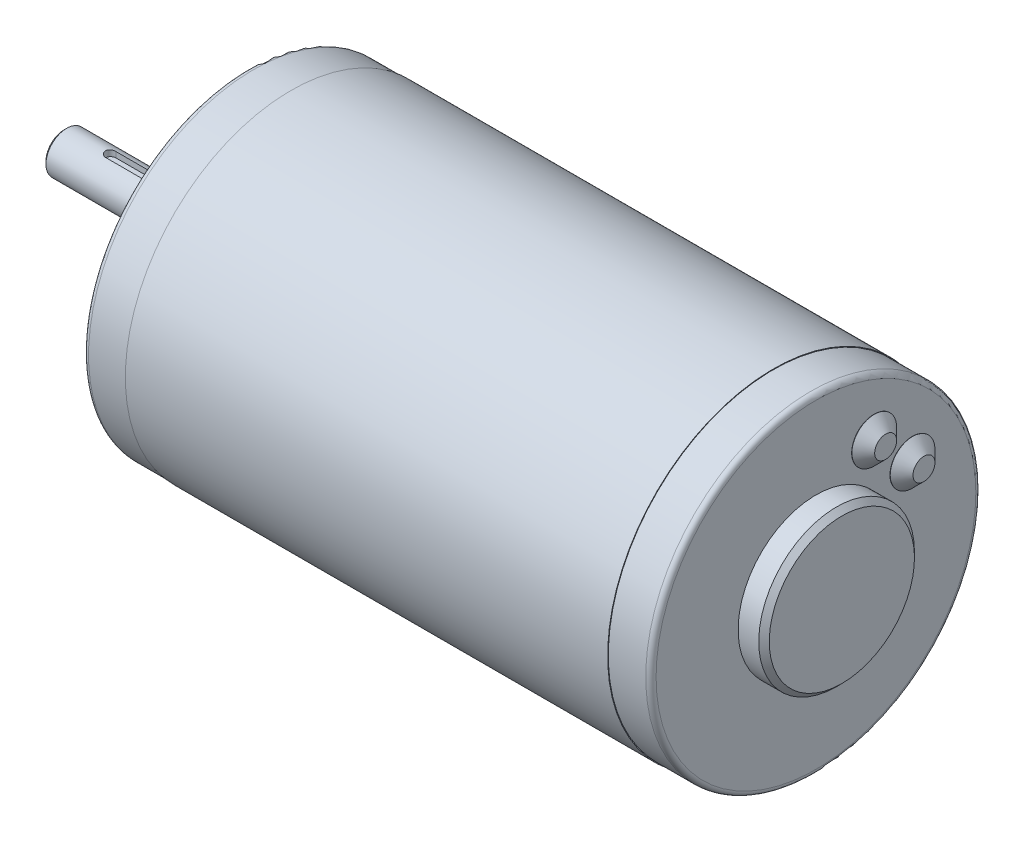
ISO-10303-21;
HEADER;
FILE_DESCRIPTION(('STEP AP214'),'2;1');
FILE_NAME('part.step','',(''),(''),'','','');
FILE_SCHEMA(('AUTOMOTIVE_DESIGN { 1 0 10303 214 1 1 1 1 }'));
ENDSEC;
DATA;
#1=APPLICATION_CONTEXT('core data for automotive mechanical design processes');
#2=APPLICATION_PROTOCOL_DEFINITION('international standard','automotive_design',2000,#1);
#3=PRODUCT_CONTEXT('',#1,'mechanical');
#4=PRODUCT('Part','Part','',(#3));
#5=PRODUCT_RELATED_PRODUCT_CATEGORY('part','',(#4));
#6=PRODUCT_DEFINITION_FORMATION('','',#4);
#7=PRODUCT_DEFINITION_CONTEXT('part definition',#1,'design');
#8=PRODUCT_DEFINITION('design','',#6,#7);
#9=PRODUCT_DEFINITION_SHAPE('','',#8);
#10=(LENGTH_UNIT() NAMED_UNIT(*) SI_UNIT(.MILLI.,.METRE.));
#11=(NAMED_UNIT(*) PLANE_ANGLE_UNIT() SI_UNIT($,.RADIAN.));
#12=(NAMED_UNIT(*) SI_UNIT($,.STERADIAN.) SOLID_ANGLE_UNIT());
#13=UNCERTAINTY_MEASURE_WITH_UNIT(LENGTH_MEASURE(1.E-05),#10,'distance_accuracy_value','');
#14=(GEOMETRIC_REPRESENTATION_CONTEXT(3) GLOBAL_UNCERTAINTY_ASSIGNED_CONTEXT((#13)) GLOBAL_UNIT_ASSIGNED_CONTEXT((#10,
#11,#12)) REPRESENTATION_CONTEXT('',''));
#15=CARTESIAN_POINT('',(0.,0.,0.));
#16=DIRECTION('',(0.,0.,1.));
#17=DIRECTION('',(1.,0.,0.));
#18=AXIS2_PLACEMENT_3D('',#15,#16,#17);
#19=CARTESIAN_POINT('',(-27.6,2.79999999999999,-1.));
#20=DIRECTION('',(0.,-1.,0.));
#21=DIRECTION('',(0.,0.,-1.));
#22=AXIS2_PLACEMENT_3D('',#19,#20,#21);
#23=PLANE('',#22);
#24=CARTESIAN_POINT('',(-7.1,2.79999999999999,0.));
#25=DIRECTION('',(0.,1.,0.));
#26=DIRECTION('',(0.,0.,1.));
#27=AXIS2_PLACEMENT_3D('',#24,#25,#26);
#28=CIRCLE('',#27,1.);
#29=CARTESIAN_POINT('',(-7.1,2.79999999999999,1.));
#30=VERTEX_POINT('',#29);
#31=CARTESIAN_POINT('',(-7.1,2.79999999999999,-1.));
#32=VERTEX_POINT('',#31);
#33=EDGE_CURVE('E79',#30,#32,#28,.T.);
#34=ORIENTED_EDGE('',*,*,#33,.T.);
#35=DIRECTION('',(1.,0.,0.));
#36=VECTOR('',#35,1.);
#37=CARTESIAN_POINT('',(-27.6,2.79999999999999,-1.));
#38=LINE('',#37,#36);
#39=CARTESIAN_POINT('',(-26.6,2.79999999999999,-1.));
#40=VERTEX_POINT('',#39);
#41=EDGE_CURVE('E74',#40,#32,#38,.T.);
#42=ORIENTED_EDGE('',*,*,#41,.F.);
#43=CARTESIAN_POINT('',(-26.6,2.79999999999999,0.));
#44=DIRECTION('',(0.,-1.,0.));
#45=DIRECTION('',(0.,0.,-1.));
#46=AXIS2_PLACEMENT_3D('',#43,#44,#45);
#47=CIRCLE('',#46,1.);
#48=CARTESIAN_POINT('',(-26.6,2.79999999999999,1.));
#49=VERTEX_POINT('',#48);
#50=EDGE_CURVE('E76',#40,#49,#47,.F.);
#51=ORIENTED_EDGE('',*,*,#50,.T.);
#52=DIRECTION('',(1.,0.,0.));
#53=VECTOR('',#52,1.);
#54=CARTESIAN_POINT('',(-27.6,2.79999999999999,1.));
#55=LINE('',#54,#53);
#56=EDGE_CURVE('E102',#49,#30,#55,.T.);
#57=ORIENTED_EDGE('',*,*,#56,.T.);
#58=EDGE_LOOP('',(#34,#42,#51,#57));
#59=FACE_BOUND('',#58,.T.);
#60=ADVANCED_FACE('F16',(#59),#23,.F.);
#61=CARTESIAN_POINT('',(-35.6,0.,0.));
#62=DIRECTION('',(-1.,0.,0.));
#63=DIRECTION('',(0.,0.,1.));
#64=AXIS2_PLACEMENT_3D('',#61,#62,#63);
#65=PLANE('',#64);
#66=CARTESIAN_POINT('',(-35.6000000000449,0.,0.));
#67=DIRECTION('',(1.,0.,0.));
#68=DIRECTION('',(0.,0.,-1.));
#69=AXIS2_PLACEMENT_3D('',#66,#67,#68);
#70=CIRCLE('',#69,3.49999999997408);
#71=CARTESIAN_POINT('',(-35.6000000000449,0.,-3.49999999997408));
#72=VERTEX_POINT('',#71);
#73=EDGE_CURVE('E325',#72,#72,#70,.T.);
#74=ORIENTED_EDGE('',*,*,#73,.F.);
#75=EDGE_LOOP('',(#74));
#76=FACE_BOUND('',#75,.T.);
#77=ADVANCED_FACE('F651',(#76),#65,.T.);
#78=CARTESIAN_POINT('',(-26.6,3.87298334620741,0.));
#79=DIRECTION('',(0.,-1.,0.));
#80=DIRECTION('',(0.,0.,-1.));
#81=AXIS2_PLACEMENT_3D('',#78,#79,#80);
#82=CYLINDRICAL_SURFACE('',#81,1.);
#83=CARTESIAN_POINT('',(-26.6,3.87298334620741,1.));
#84=CARTESIAN_POINT('',(-26.6276629851065,3.87298148580177,1.00000033749611));
#85=CARTESIAN_POINT('',(-26.6553122630182,3.8732800994947,0.998851407375366));
#86=CARTESIAN_POINT('',(-26.7104040353036,3.87445904774558,0.994271295395754));
#87=CARTESIAN_POINT('',(-26.7378465636871,3.87533928441687,0.990840497572679));
#88=CARTESIAN_POINT('',(-26.8194531732088,3.87881710972053,0.977175239382526));
#89=CARTESIAN_POINT('',(-26.8730564684822,3.88225203148808,0.963567695172493));
#90=CARTESIAN_POINT('',(-26.977124673782,3.89095422588002,0.927798076247996));
#91=CARTESIAN_POINT('',(-27.0275898782129,3.89622132630929,0.905636805423835));
#92=CARTESIAN_POINT('',(-27.1241114486473,3.90799134471939,0.853415378025864));
#93=CARTESIAN_POINT('',(-27.170166627891,3.91449459395647,0.823353103356932));
#94=CARTESIAN_POINT('',(-27.2575438819061,3.92816262398025,0.755484471828069));
#95=CARTESIAN_POINT('',(-27.2987548862455,3.93533791028915,0.717537268783975));
#96=CARTESIAN_POINT('',(-27.3743020894827,3.94945104396193,0.635275780516229));
#97=CARTESIAN_POINT('',(-27.4086371894679,3.95638885322537,0.59096047947883));
#98=CARTESIAN_POINT('',(-27.4699110016186,3.96936182283248,0.496456899401689));
#99=CARTESIAN_POINT('',(-27.496739895984,3.9753830468173,0.446195340334472));
#100=CARTESIAN_POINT('',(-27.5415247341967,3.98572346250588,0.341702590842916));
#101=CARTESIAN_POINT('',(-27.5594824242998,3.990042989147,0.287472184083007));
#102=CARTESIAN_POINT('',(-27.5856589927774,3.99641900005128,0.177744108525158));
#103=CARTESIAN_POINT('',(-27.5940676724228,3.998519529013,0.122294322002856));
#104=CARTESIAN_POINT('',(-27.6015033715433,4.00037438150815,0.0107327756816781));
#105=CARTESIAN_POINT('',(-27.6005315701923,4.00012899993444,-0.0453789000287067));
#106=CARTESIAN_POINT('',(-27.5893700363146,3.99735237365735,-0.155352492972096));
#107=CARTESIAN_POINT('',(-27.5793853834005,3.9948719867736,-0.209236701739855));
#108=CARTESIAN_POINT('',(-27.5508113208173,3.98796330636495,-0.31453871108434));
#109=CARTESIAN_POINT('',(-27.5322215304314,3.98353492665556,-0.365956402423988));
#110=CARTESIAN_POINT('',(-27.4867987193294,3.97314997761798,-0.46540728602454));
#111=CARTESIAN_POINT('',(-27.4598926057672,3.96717993827555,-0.513405629602248));
#112=CARTESIAN_POINT('',(-27.3986568701665,3.95435945541919,-0.604276631230015));
#113=CARTESIAN_POINT('',(-27.3643261297468,3.94750887933198,-0.64714851556229));
#114=CARTESIAN_POINT('',(-27.2881210879187,3.93345566022865,-0.727769389708492));
#115=CARTESIAN_POINT('',(-27.2460683634602,3.92624850477685,-0.765349103054128));
#116=CARTESIAN_POINT('',(-27.1561701330723,3.91246168284006,-0.832969575186237));
#117=CARTESIAN_POINT('',(-27.1083230467164,3.90588218842993,-0.863008270245062));
#118=CARTESIAN_POINT('',(-27.0078544021762,3.89407813586325,-0.914804709285961));
#119=CARTESIAN_POINT('',(-26.9552085351039,3.88886106009136,-0.936517017887269));
#120=CARTESIAN_POINT('',(-26.8468830715817,3.88047058807054,-0.970702351849828));
#121=CARTESIAN_POINT('',(-26.7912081448502,3.87729413761435,-0.983189189212131));
#122=CARTESIAN_POINT('',(-26.7125426192411,3.87455290681524,-0.993904635150938));
#123=CARTESIAN_POINT('',(-26.6900802967868,3.87396523110859,-0.996190790966708));
#124=CARTESIAN_POINT('',(-26.6450822100907,3.87318062488974,-0.999236757697394));
#125=CARTESIAN_POINT('',(-26.6225466240447,3.87298306219461,-0.999999038096045));
#126=CARTESIAN_POINT('',(-26.6,3.87298334620741,-1.));
#127=B_SPLINE_CURVE_WITH_KNOTS('',3,(#83,#84,#85,#86,#87,#88,#89,#90,#91,#92,#93,#94,#95,#96,
#97,#98,#99,#100,#101,#102,#103,#104,#105,#106,#107,#108,#109,#110,#111,#112,#113,#114,#115,
#116,#117,#118,#119,#120,#121,#122,#123,#124,#125,#126),.UNSPECIFIED.,.F.,.F.,(4,2,2,2,2,2,2,2,
2,2,2,2,2,2,2,2,2,2,2,2,2,4),(0.,0.0829365303397727,0.165859106084653,0.331229963080318,
0.496585282091499,0.661984974726751,0.830641897427976,0.999325753539196,1.17036187098235,
1.34136430732425,1.50890481515325,1.67642426256639,1.84022545479276,2.00403389475838,
2.16932509450376,2.33464120964329,2.50441429534542,2.67423379180967,2.84496720161068,
3.01544447539986,3.08315848722649,3.15076267731671),.UNSPECIFIED.);
#128=CARTESIAN_POINT('',(-26.6,3.87298334620741,1.));
#129=VERTEX_POINT('',#128);
#130=CARTESIAN_POINT('',(-26.6,3.87298334620741,-1.));
#131=VERTEX_POINT('',#130);
#132=EDGE_CURVE('E160',#129,#131,#127,.T.);
#133=ORIENTED_EDGE('',*,*,#132,.F.);
#134=DIRECTION('',(0.,1.,0.));
#135=VECTOR('',#134,1.);
#136=CARTESIAN_POINT('',(-26.6,2.79999999999999,1.));
#137=LINE('',#136,#135);
#138=EDGE_CURVE('E89',#129,#49,#137,.F.);
#139=ORIENTED_EDGE('',*,*,#138,.T.);
#140=ORIENTED_EDGE('',*,*,#50,.F.);
#141=DIRECTION('',(0.,1.,0.));
#142=VECTOR('',#141,1.);
#143=CARTESIAN_POINT('',(-26.6,2.79999999999999,-1.));
#144=LINE('',#143,#142);
#145=EDGE_CURVE('E83',#131,#40,#144,.F.);
#146=ORIENTED_EDGE('',*,*,#145,.F.);
#147=EDGE_LOOP('',(#133,#139,#140,#146));
#148=FACE_BOUND('',#147,.T.);
#149=ADVANCED_FACE('F86',(#148),#82,.F.);
#150=CARTESIAN_POINT('',(-27.6,2.79999999999999,-1.));
#151=DIRECTION('',(0.,0.,1.));
#152=DIRECTION('',(1.,0.,0.));
#153=AXIS2_PLACEMENT_3D('',#150,#151,#152);
#154=PLANE('',#153);
#155=DIRECTION('',(1.,0.,0.));
#156=VECTOR('',#155,1.);
#157=CARTESIAN_POINT('',(0.,3.87298334620741,-1.));
#158=LINE('',#157,#156);
#159=CARTESIAN_POINT('',(-7.1,3.87298334620741,-1.));
#160=VERTEX_POINT('',#159);
#161=EDGE_CURVE('E94',#131,#160,#158,.T.);
#162=ORIENTED_EDGE('',*,*,#161,.F.);
#163=ORIENTED_EDGE('',*,*,#145,.T.);
#164=ORIENTED_EDGE('',*,*,#41,.T.);
#165=DIRECTION('',(0.,1.,0.));
#166=VECTOR('',#165,1.);
#167=CARTESIAN_POINT('',(-7.1,2.79999999999999,-1.));
#168=LINE('',#167,#166);
#169=EDGE_CURVE('E97',#32,#160,#168,.T.);
#170=ORIENTED_EDGE('',*,*,#169,.T.);
#171=EDGE_LOOP('',(#162,#163,#164,#170));
#172=FACE_BOUND('',#171,.T.);
#173=ADVANCED_FACE('F92',(#172),#154,.T.);
#174=CARTESIAN_POINT('',(-7.1,2.79999999999999,0.));
#175=DIRECTION('',(0.,1.,0.));
#176=DIRECTION('',(0.,0.,1.));
#177=AXIS2_PLACEMENT_3D('',#174,#175,#176);
#178=CYLINDRICAL_SURFACE('',#177,1.);
#179=ORIENTED_EDGE('',*,*,#33,.F.);
#180=DIRECTION('',(0.,1.,0.));
#181=VECTOR('',#180,1.);
#182=CARTESIAN_POINT('',(-7.1,2.79999999999999,1.));
#183=LINE('',#182,#181);
#184=CARTESIAN_POINT('',(-7.1,3.87298334620741,1.));
#185=VERTEX_POINT('',#184);
#186=EDGE_CURVE('E103',#30,#185,#183,.T.);
#187=ORIENTED_EDGE('',*,*,#186,.T.);
#188=CARTESIAN_POINT('',(-7.1,3.87298334620741,-1.));
#189=CARTESIAN_POINT('',(-7.07233701489346,3.87298148580177,-1.00000033749611));
#190=CARTESIAN_POINT('',(-7.04468773698177,3.8732800994947,-0.998851407375366));
#191=CARTESIAN_POINT('',(-6.98959596469644,3.87445904774558,-0.994271295395754));
#192=CARTESIAN_POINT('',(-6.96215343631291,3.87533928441687,-0.990840497572679));
#193=CARTESIAN_POINT('',(-6.88054682679116,3.87881710972053,-0.977175239382526));
#194=CARTESIAN_POINT('',(-6.82694353151779,3.88225203148808,-0.963567695172493));
#195=CARTESIAN_POINT('',(-6.72287532621804,3.89095422588002,-0.927798076247997));
#196=CARTESIAN_POINT('',(-6.67241012178714,3.89622132630929,-0.905636805423836));
#197=CARTESIAN_POINT('',(-6.57588855135267,3.90799134471939,-0.853415378025865));
#198=CARTESIAN_POINT('',(-6.52983337210904,3.91449459395647,-0.823353103356933));
#199=CARTESIAN_POINT('',(-6.4424561180939,3.92816262398025,-0.755484471828069));
#200=CARTESIAN_POINT('',(-6.40124511375448,3.93533791028915,-0.717537268783976));
#201=CARTESIAN_POINT('',(-6.32569791051729,3.94945104396193,-0.63527578051623));
#202=CARTESIAN_POINT('',(-6.29136281053206,3.95638885322537,-0.590960479478831));
#203=CARTESIAN_POINT('',(-6.23008899838136,3.96936182283248,-0.496456899401691));
#204=CARTESIAN_POINT('',(-6.20326010401603,3.9753830468173,-0.446195340334474));
#205=CARTESIAN_POINT('',(-6.1584752658033,3.98572346250588,-0.341702590842919));
#206=CARTESIAN_POINT('',(-6.14051757570017,3.990042989147,-0.28747218408301));
#207=CARTESIAN_POINT('',(-6.11434100722257,3.99641900005128,-0.17774410852516));
#208=CARTESIAN_POINT('',(-6.10593232757718,3.998519529013,-0.122294322002858));
#209=CARTESIAN_POINT('',(-6.09849662845671,4.00037438150815,-0.0107327756816796));
#210=CARTESIAN_POINT('',(-6.09946842980766,4.00012899993444,0.0453789000287057));
#211=CARTESIAN_POINT('',(-6.11062996368545,3.99735237365735,0.155352492972096));
#212=CARTESIAN_POINT('',(-6.12061461659948,3.9948719867736,0.209236701739855));
#213=CARTESIAN_POINT('',(-6.14918867918275,3.98796330636495,0.31453871108434));
#214=CARTESIAN_POINT('',(-6.16777846956858,3.98353492665556,0.365956402423988));
#215=CARTESIAN_POINT('',(-6.21320128067065,3.97314997761798,0.465407286024539));
#216=CARTESIAN_POINT('',(-6.24010739423284,3.96717993827555,0.513405629602248));
#217=CARTESIAN_POINT('',(-6.30134312983347,3.95435945541919,0.604276631230014));
#218=CARTESIAN_POINT('',(-6.33567387025322,3.94750887933198,0.647148515562289));
#219=CARTESIAN_POINT('',(-6.41187891208131,3.93345566022865,0.72776938970849));
#220=CARTESIAN_POINT('',(-6.45393163653981,3.92624850477685,0.765349103054127));
#221=CARTESIAN_POINT('',(-6.54382986692773,3.91246168284006,0.832969575186237));
#222=CARTESIAN_POINT('',(-6.59167695328356,3.90588218842993,0.863008270245062));
#223=CARTESIAN_POINT('',(-6.69214559782377,3.89407813586325,0.914804709285962));
#224=CARTESIAN_POINT('',(-6.74479146489609,3.88886106009136,0.936517017887269));
#225=CARTESIAN_POINT('',(-6.85311692841829,3.88047058807055,0.970702351849829));
#226=CARTESIAN_POINT('',(-6.90879185514984,3.87729413761435,0.983189189212132));
#227=CARTESIAN_POINT('',(-6.9874573807589,3.87455290681524,0.993904635150938));
#228=CARTESIAN_POINT('',(-7.00991970321318,3.87396523110859,0.996190790966708));
#229=CARTESIAN_POINT('',(-7.05491778990932,3.87318062488974,0.999236757697394));
#230=CARTESIAN_POINT('',(-7.07745337595529,3.87298306219461,0.999999038096045));
#231=CARTESIAN_POINT('',(-7.1,3.87298334620741,1.));
#232=B_SPLINE_CURVE_WITH_KNOTS('',3,(#188,#189,#190,#191,#192,#193,#194,#195,#196,#197,#198,
#199,#200,#201,#202,#203,#204,#205,#206,#207,#208,#209,#210,#211,#212,#213,#214,#215,#216,#217,
#218,#219,#220,#221,#222,#223,#224,#225,#226,#227,#228,#229,#230,#231),.UNSPECIFIED.,.F.,.F.,(4,
2,2,2,2,2,2,2,2,2,2,2,2,2,2,2,2,2,2,2,2,4),(0.,0.0829365303397693,0.165859106084651,
0.331229963080317,0.496585282091498,0.661984974726749,0.830641897427974,0.999325753539193,
1.17036187098235,1.34136430732424,1.50890481515325,1.67642426256639,1.84022545479276,
2.00403389475838,2.16932509450376,2.33464120964329,2.50441429534542,2.67423379180967,
2.84496720161068,3.01544447539986,3.08315848722648,3.15076267731671),.UNSPECIFIED.);
#233=EDGE_CURVE('E151',#160,#185,#232,.T.);
#234=ORIENTED_EDGE('',*,*,#233,.F.);
#235=ORIENTED_EDGE('',*,*,#169,.F.);
#236=EDGE_LOOP('',(#179,#187,#234,#235));
#237=FACE_BOUND('',#236,.T.);
#238=ADVANCED_FACE('F166',(#237),#178,.F.);
#239=CARTESIAN_POINT('',(-27.6,2.79999999999999,1.));
#240=DIRECTION('',(0.,0.,1.));
#241=DIRECTION('',(1.,0.,0.));
#242=AXIS2_PLACEMENT_3D('',#239,#240,#241);
#243=PLANE('',#242);
#244=ORIENTED_EDGE('',*,*,#186,.F.);
#245=ORIENTED_EDGE('',*,*,#56,.F.);
#246=ORIENTED_EDGE('',*,*,#138,.F.);
#247=DIRECTION('',(1.,0.,0.));
#248=VECTOR('',#247,1.);
#249=CARTESIAN_POINT('',(0.,3.87298334620741,1.));
#250=LINE('',#249,#248);
#251=EDGE_CURVE('E159',#185,#129,#250,.F.);
#252=ORIENTED_EDGE('',*,*,#251,.F.);
#253=EDGE_LOOP('',(#244,#245,#246,#252));
#254=FACE_BOUND('',#253,.T.);
#255=ADVANCED_FACE('F181',(#254),#243,.F.);
#256=CARTESIAN_POINT('',(-35.0999999999999,0.,0.));
#257=DIRECTION('',(1.,0.,0.));
#258=DIRECTION('',(0.,0.,-1.));
#259=AXIS2_PLACEMENT_3D('',#256,#257,#258);
#260=CONICAL_SURFACE('',#259,3.99999999996226,0.785398163340605);
#261=ORIENTED_EDGE('',*,*,#73,.T.);
#262=EDGE_LOOP('',(#261));
#263=FACE_BOUND('',#262,.T.);
#264=CARTESIAN_POINT('',(-35.1,0.,0.));
#265=DIRECTION('',(1.,0.,0.));
#266=DIRECTION('',(0.,0.,-1.));
#267=AXIS2_PLACEMENT_3D('',#264,#265,#266);
#268=CIRCLE('',#267,4.);
#269=CARTESIAN_POINT('',(-35.1,0.,-4.));
#270=VERTEX_POINT('',#269);
#271=EDGE_CURVE('E150',#270,#270,#268,.T.);
#272=ORIENTED_EDGE('',*,*,#271,.F.);
#273=EDGE_LOOP('',(#272));
#274=FACE_BOUND('',#273,.T.);
#275=ADVANCED_FACE('F176',(#263,#274),#260,.T.);
#276=CARTESIAN_POINT('',(0.,0.,0.));
#277=DIRECTION('',(1.,0.,0.));
#278=DIRECTION('',(0.,0.,-1.));
#279=AXIS2_PLACEMENT_3D('',#276,#277,#278);
#280=CYLINDRICAL_SURFACE('',#279,4.);
#281=ORIENTED_EDGE('',*,*,#271,.T.);
#282=EDGE_LOOP('',(#281));
#283=FACE_BOUND('',#282,.T.);
#284=CARTESIAN_POINT('',(-4.,0.,0.));
#285=DIRECTION('',(1.,0.,0.));
#286=DIRECTION('',(0.,0.,-1.));
#287=AXIS2_PLACEMENT_3D('',#284,#285,#286);
#288=CIRCLE('',#287,4.);
#289=CARTESIAN_POINT('',(-4.,0.,-4.));
#290=VERTEX_POINT('',#289);
#291=EDGE_CURVE('E147',#290,#290,#288,.T.);
#292=ORIENTED_EDGE('',*,*,#291,.F.);
#293=EDGE_LOOP('',(#292));
#294=FACE_BOUND('',#293,.T.);
#295=ORIENTED_EDGE('',*,*,#233,.T.);
#296=ORIENTED_EDGE('',*,*,#251,.T.);
#297=ORIENTED_EDGE('',*,*,#132,.T.);
#298=ORIENTED_EDGE('',*,*,#161,.T.);
#299=EDGE_LOOP('',(#295,#296,#297,#298));
#300=FACE_BOUND('',#299,.T.);
#301=ADVANCED_FACE('F170',(#283,#294,#300),#280,.T.);
#302=CARTESIAN_POINT('',(-4.,4.,0.));
#303=DIRECTION('',(-1.,0.,0.));
#304=DIRECTION('',(0.,0.,1.));
#305=AXIS2_PLACEMENT_3D('',#302,#303,#304);
#306=PLANE('',#305);
#307=ORIENTED_EDGE('',*,*,#291,.T.);
#308=EDGE_LOOP('',(#307));
#309=FACE_BOUND('',#308,.T.);
#310=CARTESIAN_POINT('',(-4.,0.,0.));
#311=DIRECTION('',(1.,0.,0.));
#312=DIRECTION('',(0.,1.,0.));
#313=AXIS2_PLACEMENT_3D('',#310,#311,#312);
#314=CIRCLE('',#313,8.509);
#315=CARTESIAN_POINT('',(-4.,8.509,0.));
#316=VERTEX_POINT('',#315);
#317=EDGE_CURVE('E144',#316,#316,#314,.T.);
#318=ORIENTED_EDGE('',*,*,#317,.F.);
#319=EDGE_LOOP('',(#318));
#320=FACE_BOUND('',#319,.T.);
#321=ADVANCED_FACE('F175',(#309,#320),#306,.T.);
#322=CARTESIAN_POINT('',(111.8479,18.6070906828553,-11.2073596390943));
#323=DIRECTION('',(1.,0.,0.));
#324=DIRECTION('',(0.,0.,-1.));
#325=AXIS2_PLACEMENT_3D('',#322,#323,#324);
#326=PLANE('',#325);
#327=CARTESIAN_POINT('',(111.84789999993,18.6070906828553,-11.2073596390943));
#328=DIRECTION('',(-1.,0.,0.));
#329=DIRECTION('',(0.,-1.,0.));
#330=AXIS2_PLACEMENT_3D('',#327,#328,#329);
#331=CIRCLE('',#330,2.11800000003146);
#332=CARTESIAN_POINT('',(111.84789999993,16.4890906828238,-11.2073596390943));
#333=VERTEX_POINT('',#332);
#334=EDGE_CURVE('E141',#333,#333,#331,.T.);
#335=ORIENTED_EDGE('',*,*,#334,.F.);
#336=EDGE_LOOP('',(#335));
#337=FACE_BOUND('',#336,.T.);
#338=ADVANCED_FACE('F384',(#337),#326,.T.);
#339=CARTESIAN_POINT('',(114.6,15.0368,0.));
#340=DIRECTION('',(1.,0.,0.));
#341=DIRECTION('',(0.,0.,-1.));
#342=AXIS2_PLACEMENT_3D('',#339,#340,#341);
#343=PLANE('',#342);
#344=CARTESIAN_POINT('',(114.6,0.,0.));
#345=DIRECTION('',(-1.,0.,0.));
#346=DIRECTION('',(0.,-1.,0.));
#347=AXIS2_PLACEMENT_3D('',#344,#345,#346);
#348=CIRCLE('',#347,14.0208);
#349=CARTESIAN_POINT('',(114.6,-14.0208,0.));
#350=VERTEX_POINT('',#349);
#351=EDGE_CURVE('E138',#350,#350,#348,.T.);
#352=ORIENTED_EDGE('',*,*,#351,.F.);
#353=EDGE_LOOP('',(#352));
#354=FACE_BOUND('',#353,.T.);
#355=ADVANCED_FACE('F425',(#354),#343,.T.);
#356=CARTESIAN_POINT('',(111.8479,11.2073596390943,-18.6070906828553));
#357=DIRECTION('',(1.,0.,0.));
#358=DIRECTION('',(0.,0.,-1.));
#359=AXIS2_PLACEMENT_3D('',#356,#357,#358);
#360=PLANE('',#359);
#361=CARTESIAN_POINT('',(111.84789999993,11.2073596390943,-18.6070906828553));
#362=DIRECTION('',(-1.,0.,0.));
#363=DIRECTION('',(0.,0.,1.));
#364=AXIS2_PLACEMENT_3D('',#361,#362,#363);
#365=CIRCLE('',#364,2.1180000000021);
#366=CARTESIAN_POINT('',(111.84789999993,11.2073596390943,-16.4890906828532));
#367=VERTEX_POINT('',#366);
#368=EDGE_CURVE('E134',#367,#367,#365,.T.);
#369=ORIENTED_EDGE('',*,*,#368,.F.);
#370=EDGE_LOOP('',(#369));
#371=FACE_BOUND('',#370,.T.);
#372=ADVANCED_FACE('F428',(#371),#360,.T.);
#373=CARTESIAN_POINT('',(13.6143999999945,25.4,0.));
#374=DIRECTION('',(-1.,0.,0.));
#375=DIRECTION('',(0.,0.,1.));
#376=AXIS2_PLACEMENT_3D('',#373,#374,#375);
#377=CONICAL_SURFACE('',#376,2.01929999997219,1.02974425867198);
#378=CARTESIAN_POINT('',(14.827717847993,25.4,0.));
#379=VERTEX_POINT('',#378);
#380=VERTEX_LOOP('',#379);
#381=FACE_BOUND('',#380,.T.);
#382=CARTESIAN_POINT('',(13.6144,25.4,0.));
#383=DIRECTION('',(-1.,0.,0.));
#384=DIRECTION('',(0.,0.,1.));
#385=AXIS2_PLACEMENT_3D('',#382,#383,#384);
#386=CIRCLE('',#385,2.0193);
#387=CARTESIAN_POINT('',(13.6144,25.4,2.0193));
#388=VERTEX_POINT('',#387);
#389=EDGE_CURVE('E137',#388,#388,#386,.T.);
#390=ORIENTED_EDGE('',*,*,#389,.T.);
#391=EDGE_LOOP('',(#390));
#392=FACE_BOUND('',#391,.T.);
#393=ADVANCED_FACE('F443',(#381,#392),#377,.F.);
#394=CARTESIAN_POINT('',(13.6143999999945,-25.4,0.));
#395=DIRECTION('',(-1.,0.,0.));
#396=DIRECTION('',(0.,0.,1.));
#397=AXIS2_PLACEMENT_3D('',#394,#395,#396);
#398=CONICAL_SURFACE('',#397,2.01929999997219,1.02974425867198);
#399=CARTESIAN_POINT('',(14.827717847993,-25.4,0.));
#400=VERTEX_POINT('',#399);
#401=VERTEX_LOOP('',#400);
#402=FACE_BOUND('',#401,.T.);
#403=CARTESIAN_POINT('',(13.6144,-25.4,0.));
#404=DIRECTION('',(-1.,0.,0.));
#405=DIRECTION('',(0.,0.,1.));
#406=AXIS2_PLACEMENT_3D('',#403,#404,#405);
#407=CIRCLE('',#406,2.0193);
#408=CARTESIAN_POINT('',(13.6144,-25.4,2.0193));
#409=VERTEX_POINT('',#408);
#410=EDGE_CURVE('E315',#409,#409,#407,.T.);
#411=ORIENTED_EDGE('',*,*,#410,.T.);
#412=EDGE_LOOP('',(#411));
#413=FACE_BOUND('',#412,.T.);
#414=ADVANCED_FACE('F374',(#402,#413),#398,.F.);
#415=CARTESIAN_POINT('',(-2.984,0.,0.));
#416=DIRECTION('',(1.,0.,0.));
#417=DIRECTION('',(0.,1.,0.));
#418=AXIS2_PLACEMENT_3D('',#415,#416,#417);
#419=CONICAL_SURFACE('',#418,9.525,0.78539816339745);
#420=ORIENTED_EDGE('',*,*,#317,.T.);
#421=EDGE_LOOP('',(#420));
#422=FACE_BOUND('',#421,.T.);
#423=CARTESIAN_POINT('',(-2.984,0.,0.));
#424=DIRECTION('',(1.,0.,0.));
#425=DIRECTION('',(0.,0.,-1.));
#426=AXIS2_PLACEMENT_3D('',#423,#424,#425);
#427=CIRCLE('',#426,9.525);
#428=CARTESIAN_POINT('',(-2.984,0.,-9.525));
#429=VERTEX_POINT('',#428);
#430=EDGE_CURVE('E312',#429,#429,#427,.T.);
#431=ORIENTED_EDGE('',*,*,#430,.F.);
#432=EDGE_LOOP('',(#431));
#433=FACE_BOUND('',#432,.T.);
#434=ADVANCED_FACE('F369',(#422,#433),#419,.T.);
#435=CARTESIAN_POINT('',(109.647900000027,18.6070906828553,-11.2073596390943));
#436=DIRECTION('',(-1.,0.,0.));
#437=DIRECTION('',(0.,-1.,0.));
#438=AXIS2_PLACEMENT_3D('',#435,#436,#437);
#439=CONICAL_SURFACE('',#438,4.31799999987712,0.785398163384529);
#440=CARTESIAN_POINT('',(109.6479,18.6070906828553,-11.2073596390943));
#441=DIRECTION('',(-1.,0.,0.));
#442=DIRECTION('',(0.,0.,1.));
#443=AXIS2_PLACEMENT_3D('',#440,#441,#442);
#444=CIRCLE('',#443,4.318);
#445=CARTESIAN_POINT('',(109.6479,18.6070906828553,-6.88935963909434));
#446=VERTEX_POINT('',#445);
#447=EDGE_CURVE('E309',#446,#446,#444,.T.);
#448=ORIENTED_EDGE('',*,*,#447,.F.);
#449=EDGE_LOOP('',(#448));
#450=FACE_BOUND('',#449,.T.);
#451=ORIENTED_EDGE('',*,*,#334,.T.);
#452=EDGE_LOOP('',(#451));
#453=FACE_BOUND('',#452,.T.);
#454=ADVANCED_FACE('F373',(#450,#453),#439,.T.);
#455=CARTESIAN_POINT('',(113.584,0.,0.));
#456=DIRECTION('',(-1.,0.,0.));
#457=DIRECTION('',(0.,-1.,0.));
#458=AXIS2_PLACEMENT_3D('',#455,#456,#457);
#459=CONICAL_SURFACE('',#458,15.0368,0.785398163397441);
#460=ORIENTED_EDGE('',*,*,#351,.T.);
#461=EDGE_LOOP('',(#460));
#462=FACE_BOUND('',#461,.T.);
#463=CARTESIAN_POINT('',(113.584,0.,0.));
#464=DIRECTION('',(1.,0.,0.));
#465=DIRECTION('',(0.,0.,-1.));
#466=AXIS2_PLACEMENT_3D('',#463,#464,#465);
#467=CIRCLE('',#466,15.0368);
#468=CARTESIAN_POINT('',(113.584,0.,-15.0368));
#469=VERTEX_POINT('',#468);
#470=EDGE_CURVE('E306',#469,#469,#467,.F.);
#471=ORIENTED_EDGE('',*,*,#470,.F.);
#472=EDGE_LOOP('',(#471));
#473=FACE_BOUND('',#472,.T.);
#474=ADVANCED_FACE('F416',(#462,#473),#459,.T.);
#475=CARTESIAN_POINT('',(109.647900000084,11.2073596390943,-18.6070906828553));
#476=DIRECTION('',(-1.,0.,0.));
#477=DIRECTION('',(0.,0.,1.));
#478=AXIS2_PLACEMENT_3D('',#475,#476,#477);
#479=CONICAL_SURFACE('',#478,4.31799999990461,0.785398163410367);
#480=CARTESIAN_POINT('',(109.6479,11.2073596390943,-18.6070906828553));
#481=DIRECTION('',(-1.,0.,0.));
#482=DIRECTION('',(0.,0.,1.));
#483=AXIS2_PLACEMENT_3D('',#480,#481,#482);
#484=CIRCLE('',#483,4.318);
#485=CARTESIAN_POINT('',(109.6479,11.2073596390943,-14.2890906828553));
#486=VERTEX_POINT('',#485);
#487=EDGE_CURVE('E133',#486,#486,#484,.T.);
#488=ORIENTED_EDGE('',*,*,#487,.F.);
#489=EDGE_LOOP('',(#488));
#490=FACE_BOUND('',#489,.T.);
#491=ORIENTED_EDGE('',*,*,#368,.T.);
#492=EDGE_LOOP('',(#491));
#493=FACE_BOUND('',#492,.T.);
#494=ADVANCED_FACE('F419',(#490,#493),#479,.T.);
#495=CARTESIAN_POINT('',(0.,25.4,0.));
#496=DIRECTION('',(-1.,0.,0.));
#497=DIRECTION('',(0.,0.,1.));
#498=AXIS2_PLACEMENT_3D('',#495,#496,#497);
#499=CYLINDRICAL_SURFACE('',#498,2.0193);
#500=CARTESIAN_POINT('',(0.,25.4,0.));
#501=DIRECTION('',(-1.,0.,0.));
#502=DIRECTION('',(0.,0.,1.));
#503=AXIS2_PLACEMENT_3D('',#500,#501,#502);
#504=CIRCLE('',#503,2.0193);
#505=CARTESIAN_POINT('',(0.,25.4,2.0193));
#506=VERTEX_POINT('',#505);
#507=EDGE_CURVE('E130',#506,#506,#504,.F.);
#508=ORIENTED_EDGE('',*,*,#507,.F.);
#509=EDGE_LOOP('',(#508));
#510=FACE_BOUND('',#509,.T.);
#511=ORIENTED_EDGE('',*,*,#389,.F.);
#512=EDGE_LOOP('',(#511));
#513=FACE_BOUND('',#512,.T.);
#514=ADVANCED_FACE('F485',(#510,#513),#499,.F.);
#515=CARTESIAN_POINT('',(0.,-25.4,0.));
#516=DIRECTION('',(-1.,0.,0.));
#517=DIRECTION('',(0.,0.,1.));
#518=AXIS2_PLACEMENT_3D('',#515,#516,#517);
#519=CYLINDRICAL_SURFACE('',#518,2.0193);
#520=CARTESIAN_POINT('',(0.,-25.4,0.));
#521=DIRECTION('',(-1.,0.,0.));
#522=DIRECTION('',(0.,0.,1.));
#523=AXIS2_PLACEMENT_3D('',#520,#521,#522);
#524=CIRCLE('',#523,2.0193);
#525=CARTESIAN_POINT('',(0.,-25.4,2.0193));
#526=VERTEX_POINT('',#525);
#527=EDGE_CURVE('E127',#526,#526,#524,.F.);
#528=ORIENTED_EDGE('',*,*,#527,.F.);
#529=EDGE_LOOP('',(#528));
#530=FACE_BOUND('',#529,.T.);
#531=ORIENTED_EDGE('',*,*,#410,.F.);
#532=EDGE_LOOP('',(#531));
#533=FACE_BOUND('',#532,.T.);
#534=ADVANCED_FACE('F362',(#530,#533),#519,.F.);
#535=CARTESIAN_POINT('',(0.,0.,0.));
#536=DIRECTION('',(1.,0.,0.));
#537=DIRECTION('',(0.,0.,-1.));
#538=AXIS2_PLACEMENT_3D('',#535,#536,#537);
#539=CYLINDRICAL_SURFACE('',#538,9.525);
#540=ORIENTED_EDGE('',*,*,#430,.T.);
#541=EDGE_LOOP('',(#540));
#542=FACE_BOUND('',#541,.T.);
#543=CARTESIAN_POINT('',(0.,0.,0.));
#544=DIRECTION('',(1.,0.,0.));
#545=DIRECTION('',(0.,0.,-1.));
#546=AXIS2_PLACEMENT_3D('',#543,#544,#545);
#547=CIRCLE('',#546,9.525);
#548=CARTESIAN_POINT('',(0.,0.,-9.525));
#549=VERTEX_POINT('',#548);
#550=EDGE_CURVE('E124',#549,#549,#547,.T.);
#551=ORIENTED_EDGE('',*,*,#550,.F.);
#552=EDGE_LOOP('',(#551));
#553=FACE_BOUND('',#552,.T.);
#554=ADVANCED_FACE('F357',(#542,#553),#539,.T.);
#555=CARTESIAN_POINT('',(111.8479,18.6070906828553,-11.2073596390943));
#556=DIRECTION('',(-1.,0.,0.));
#557=DIRECTION('',(0.,0.,1.));
#558=AXIS2_PLACEMENT_3D('',#555,#556,#557);
#559=CYLINDRICAL_SURFACE('',#558,4.318);
#560=CARTESIAN_POINT('',(109.6,18.6070906828553,-11.2073596390943));
#561=DIRECTION('',(-1.,0.,0.));
#562=DIRECTION('',(0.,0.,1.));
#563=AXIS2_PLACEMENT_3D('',#560,#561,#562);
#564=CIRCLE('',#563,4.318);
#565=CARTESIAN_POINT('',(109.6,18.6070906828553,-6.88935963909434));
#566=VERTEX_POINT('',#565);
#567=EDGE_CURVE('E121',#566,#566,#564,.T.);
#568=ORIENTED_EDGE('',*,*,#567,.F.);
#569=EDGE_LOOP('',(#568));
#570=FACE_BOUND('',#569,.T.);
#571=ORIENTED_EDGE('',*,*,#447,.T.);
#572=EDGE_LOOP('',(#571));
#573=FACE_BOUND('',#572,.T.);
#574=ADVANCED_FACE('F361',(#570,#573),#559,.T.);
#575=CARTESIAN_POINT('',(0.,0.,0.));
#576=DIRECTION('',(1.,0.,0.));
#577=DIRECTION('',(0.,0.,-1.));
#578=AXIS2_PLACEMENT_3D('',#575,#576,#577);
#579=CYLINDRICAL_SURFACE('',#578,15.0368);
#580=CARTESIAN_POINT('',(109.6,0.,0.));
#581=DIRECTION('',(1.,0.,0.));
#582=DIRECTION('',(0.,0.,-1.));
#583=AXIS2_PLACEMENT_3D('',#580,#581,#582);
#584=CIRCLE('',#583,15.0368);
#585=CARTESIAN_POINT('',(109.6,0.,-15.0368));
#586=VERTEX_POINT('',#585);
#587=EDGE_CURVE('E118',#586,#586,#584,.F.);
#588=ORIENTED_EDGE('',*,*,#587,.F.);
#589=EDGE_LOOP('',(#588));
#590=FACE_BOUND('',#589,.T.);
#591=ORIENTED_EDGE('',*,*,#470,.T.);
#592=EDGE_LOOP('',(#591));
#593=FACE_BOUND('',#592,.T.);
#594=ADVANCED_FACE('F408',(#590,#593),#579,.T.);
#595=CARTESIAN_POINT('',(111.8479,11.2073596390943,-18.6070906828553));
#596=DIRECTION('',(-1.,0.,0.));
#597=DIRECTION('',(0.,0.,1.));
#598=AXIS2_PLACEMENT_3D('',#595,#596,#597);
#599=CYLINDRICAL_SURFACE('',#598,4.318);
#600=CARTESIAN_POINT('',(109.6,11.2073596390943,-18.6070906828553));
#601=DIRECTION('',(-1.,0.,0.));
#602=DIRECTION('',(0.,0.,1.));
#603=AXIS2_PLACEMENT_3D('',#600,#601,#602);
#604=CIRCLE('',#603,4.318);
#605=CARTESIAN_POINT('',(109.6,11.2073596390943,-14.2890906828553));
#606=VERTEX_POINT('',#605);
#607=EDGE_CURVE('E114',#606,#606,#604,.T.);
#608=ORIENTED_EDGE('',*,*,#607,.F.);
#609=EDGE_LOOP('',(#608));
#610=FACE_BOUND('',#609,.T.);
#611=ORIENTED_EDGE('',*,*,#487,.T.);
#612=EDGE_LOOP('',(#611));
#613=FACE_BOUND('',#612,.T.);
#614=ADVANCED_FACE('F392',(#610,#613),#599,.T.);
#615=CARTESIAN_POINT('',(0.,9.525,0.));
#616=DIRECTION('',(-1.,0.,0.));
#617=DIRECTION('',(0.,0.,1.));
#618=AXIS2_PLACEMENT_3D('',#615,#616,#617);
#619=PLANE('',#618);
#620=ORIENTED_EDGE('',*,*,#550,.T.);
#621=EDGE_LOOP('',(#620));
#622=FACE_BOUND('',#621,.T.);
#623=CARTESIAN_POINT('',(0.,0.,0.));
#624=DIRECTION('',(1.,0.,0.));
#625=DIRECTION('',(0.,0.,-1.));
#626=AXIS2_PLACEMENT_3D('',#623,#624,#625);
#627=CIRCLE('',#626,30.877);
#628=CARTESIAN_POINT('',(0.,0.,-30.877));
#629=VERTEX_POINT('',#628);
#630=CARTESIAN_POINT('',(0.,0.,30.877));
#631=VERTEX_POINT('',#630);
#632=EDGE_CURVE('E117',#629,#631,#627,.T.);
#633=ORIENTED_EDGE('',*,*,#632,.F.);
#634=CARTESIAN_POINT('',(0.,0.,0.));
#635=DIRECTION('',(1.,0.,0.));
#636=DIRECTION('',(0.,0.,1.));
#637=AXIS2_PLACEMENT_3D('',#634,#635,#636);
#638=CIRCLE('',#637,30.877);
#639=EDGE_CURVE('E285',#631,#629,#638,.T.);
#640=ORIENTED_EDGE('',*,*,#639,.F.);
#641=EDGE_LOOP('',(#633,#640));
#642=FACE_BOUND('',#641,.T.);
#643=ORIENTED_EDGE('',*,*,#527,.T.);
#644=EDGE_LOOP('',(#643));
#645=FACE_BOUND('',#644,.T.);
#646=ORIENTED_EDGE('',*,*,#507,.T.);
#647=EDGE_LOOP('',(#646));
#648=FACE_BOUND('',#647,.T.);
#649=ADVANCED_FACE('F251',(#622,#642,#645,#648),#619,.T.);
#650=CARTESIAN_POINT('',(109.6,31.877,0.));
#651=DIRECTION('',(1.,0.,0.));
#652=DIRECTION('',(0.,0.,-1.));
#653=AXIS2_PLACEMENT_3D('',#650,#651,#652);
#654=PLANE('',#653);
#655=ORIENTED_EDGE('',*,*,#607,.T.);
#656=EDGE_LOOP('',(#655));
#657=FACE_BOUND('',#656,.T.);
#658=ORIENTED_EDGE('',*,*,#587,.T.);
#659=EDGE_LOOP('',(#658));
#660=FACE_BOUND('',#659,.T.);
#661=CARTESIAN_POINT('',(109.6,0.,0.));
#662=DIRECTION('',(-1.,0.,0.));
#663=DIRECTION('',(0.,0.,1.));
#664=AXIS2_PLACEMENT_3D('',#661,#662,#663);
#665=CIRCLE('',#664,30.877);
#666=CARTESIAN_POINT('',(109.6,0.,30.877));
#667=VERTEX_POINT('',#666);
#668=CARTESIAN_POINT('',(109.6,0.,-30.877));
#669=VERTEX_POINT('',#668);
#670=EDGE_CURVE('E35',#667,#669,#665,.T.);
#671=ORIENTED_EDGE('',*,*,#670,.F.);
#672=CARTESIAN_POINT('',(109.6,0.,0.));
#673=DIRECTION('',(-1.,0.,0.));
#674=DIRECTION('',(0.,0.,-1.));
#675=AXIS2_PLACEMENT_3D('',#672,#673,#674);
#676=CIRCLE('',#675,30.877);
#677=EDGE_CURVE('E233',#669,#667,#676,.T.);
#678=ORIENTED_EDGE('',*,*,#677,.F.);
#679=EDGE_LOOP('',(#671,#678));
#680=FACE_BOUND('',#679,.T.);
#681=ORIENTED_EDGE('',*,*,#567,.T.);
#682=EDGE_LOOP('',(#681));
#683=FACE_BOUND('',#682,.T.);
#684=ADVANCED_FACE('F242',(#657,#660,#680,#683),#654,.T.);
#685=CARTESIAN_POINT('',(0.999999999999999,0.,0.));
#686=DIRECTION('',(-1.,0.,0.));
#687=DIRECTION('',(0.,0.,1.));
#688=AXIS2_PLACEMENT_3D('',#685,#686,#687);
#689=TOROIDAL_SURFACE('',#688,30.877,1.);
#690=CARTESIAN_POINT('',(0.999999999999999,0.,0.));
#691=DIRECTION('',(1.,0.,0.));
#692=DIRECTION('',(0.,0.,-1.));
#693=AXIS2_PLACEMENT_3D('',#690,#691,#692);
#694=CIRCLE('',#693,31.877);
#695=CARTESIAN_POINT('',(0.999999999999999,0.,-31.877));
#696=VERTEX_POINT('',#695);
#697=EDGE_CURVE('E231',#696,#696,#694,.T.);
#698=ORIENTED_EDGE('',*,*,#697,.F.);
#699=EDGE_LOOP('',(#698));
#700=FACE_BOUND('',#699,.T.);
#701=ORIENTED_EDGE('',*,*,#639,.T.);
#702=ORIENTED_EDGE('',*,*,#632,.T.);
#703=EDGE_LOOP('',(#701,#702));
#704=FACE_BOUND('',#703,.T.);
#705=ADVANCED_FACE('F220',(#700,#704),#689,.T.);
#706=CARTESIAN_POINT('',(108.6,0.,0.));
#707=DIRECTION('',(1.,0.,0.));
#708=DIRECTION('',(0.,0.,-1.));
#709=AXIS2_PLACEMENT_3D('',#706,#707,#708);
#710=TOROIDAL_SURFACE('',#709,30.877,1.);
#711=CARTESIAN_POINT('',(108.6,0.,0.));
#712=DIRECTION('',(1.,0.,0.));
#713=DIRECTION('',(0.,0.,-1.));
#714=AXIS2_PLACEMENT_3D('',#711,#712,#713);
#715=CIRCLE('',#714,31.877);
#716=CARTESIAN_POINT('',(108.6,0.,-31.877));
#717=VERTEX_POINT('',#716);
#718=EDGE_CURVE('E113',#717,#717,#715,.F.);
#719=ORIENTED_EDGE('',*,*,#718,.F.);
#720=EDGE_LOOP('',(#719));
#721=FACE_BOUND('',#720,.T.);
#722=ORIENTED_EDGE('',*,*,#677,.T.);
#723=ORIENTED_EDGE('',*,*,#670,.T.);
#724=EDGE_LOOP('',(#722,#723));
#725=FACE_BOUND('',#724,.T.);
#726=ADVANCED_FACE('F215',(#721,#725),#710,.T.);
#727=CARTESIAN_POINT('',(0.,0.,0.));
#728=DIRECTION('',(1.,0.,0.));
#729=DIRECTION('',(0.,0.,-1.));
#730=AXIS2_PLACEMENT_3D('',#727,#728,#729);
#731=CYLINDRICAL_SURFACE('',#730,31.877);
#732=ORIENTED_EDGE('',*,*,#697,.T.);
#733=EDGE_LOOP('',(#732));
#734=FACE_BOUND('',#733,.T.);
#735=CARTESIAN_POINT('',(8.2296,0.,0.));
#736=DIRECTION('',(1.,0.,0.));
#737=DIRECTION('',(0.,0.,-1.));
#738=AXIS2_PLACEMENT_3D('',#735,#736,#737);
#739=CIRCLE('',#738,31.877);
#740=CARTESIAN_POINT('',(8.2296,0.,-31.877));
#741=VERTEX_POINT('',#740);
#742=EDGE_CURVE('E110',#741,#741,#739,.T.);
#743=ORIENTED_EDGE('',*,*,#742,.F.);
#744=EDGE_LOOP('',(#743));
#745=FACE_BOUND('',#744,.T.);
#746=ADVANCED_FACE('F211',(#734,#745),#731,.T.);
#747=CARTESIAN_POINT('',(0.,0.,0.));
#748=DIRECTION('',(1.,0.,0.));
#749=DIRECTION('',(0.,0.,-1.));
#750=AXIS2_PLACEMENT_3D('',#747,#748,#749);
#751=CYLINDRICAL_SURFACE('',#750,31.877);
#752=CARTESIAN_POINT('',(101.3704,0.,0.));
#753=DIRECTION('',(1.,0.,0.));
#754=DIRECTION('',(0.,0.,-1.));
#755=AXIS2_PLACEMENT_3D('',#752,#753,#754);
#756=CIRCLE('',#755,31.877);
#757=CARTESIAN_POINT('',(101.3704,0.,-31.877));
#758=VERTEX_POINT('',#757);
#759=EDGE_CURVE('E107',#758,#758,#756,.F.);
#760=ORIENTED_EDGE('',*,*,#759,.F.);
#761=EDGE_LOOP('',(#760));
#762=FACE_BOUND('',#761,.T.);
#763=ORIENTED_EDGE('',*,*,#718,.T.);
#764=EDGE_LOOP('',(#763));
#765=FACE_BOUND('',#764,.T.);
#766=ADVANCED_FACE('F207',(#762,#765),#751,.T.);
#767=CARTESIAN_POINT('',(8.2296,31.877,0.));
#768=DIRECTION('',(-1.,0.,0.));
#769=DIRECTION('',(0.,0.,1.));
#770=AXIS2_PLACEMENT_3D('',#767,#768,#769);
#771=PLANE('',#770);
#772=CARTESIAN_POINT('',(8.2296,0.,0.));
#773=DIRECTION('',(1.,0.,0.));
#774=DIRECTION('',(0.,0.,-1.));
#775=AXIS2_PLACEMENT_3D('',#772,#773,#774);
#776=CIRCLE('',#775,32.004);
#777=CARTESIAN_POINT('',(8.2296,0.,-32.004));
#778=VERTEX_POINT('',#777);
#779=EDGE_CURVE('E27',#778,#778,#776,.T.);
#780=ORIENTED_EDGE('',*,*,#779,.F.);
#781=EDGE_LOOP('',(#780));
#782=FACE_BOUND('',#781,.T.);
#783=ORIENTED_EDGE('',*,*,#742,.T.);
#784=EDGE_LOOP('',(#783));
#785=FACE_BOUND('',#784,.T.);
#786=ADVANCED_FACE('F200',(#782,#785),#771,.T.);
#787=CARTESIAN_POINT('',(101.3704,32.004,0.));
#788=DIRECTION('',(1.,0.,0.));
#789=DIRECTION('',(0.,0.,-1.));
#790=AXIS2_PLACEMENT_3D('',#787,#788,#789);
#791=PLANE('',#790);
#792=ORIENTED_EDGE('',*,*,#759,.T.);
#793=EDGE_LOOP('',(#792));
#794=FACE_BOUND('',#793,.T.);
#795=CARTESIAN_POINT('',(101.3704,0.,0.));
#796=DIRECTION('',(1.,0.,0.));
#797=DIRECTION('',(0.,0.,-1.));
#798=AXIS2_PLACEMENT_3D('',#795,#796,#797);
#799=CIRCLE('',#798,32.004);
#800=CARTESIAN_POINT('',(101.3704,0.,-32.004));
#801=VERTEX_POINT('',#800);
#802=EDGE_CURVE('E11',#801,#801,#799,.F.);
#803=ORIENTED_EDGE('',*,*,#802,.F.);
#804=EDGE_LOOP('',(#803));
#805=FACE_BOUND('',#804,.T.);
#806=ADVANCED_FACE('F193',(#794,#805),#791,.T.);
#807=CARTESIAN_POINT('',(0.,0.,0.));
#808=DIRECTION('',(1.,0.,0.));
#809=DIRECTION('',(0.,0.,-1.));
#810=AXIS2_PLACEMENT_3D('',#807,#808,#809);
#811=CYLINDRICAL_SURFACE('',#810,32.004);
#812=ORIENTED_EDGE('',*,*,#802,.T.);
#813=EDGE_LOOP('',(#812));
#814=FACE_BOUND('',#813,.T.);
#815=ORIENTED_EDGE('',*,*,#779,.T.);
#816=EDGE_LOOP('',(#815));
#817=FACE_BOUND('',#816,.T.);
#818=ADVANCED_FACE('F191',(#814,#817),#811,.T.);
#819=CLOSED_SHELL('',(#60,#77,#149,#173,#238,#255,#275,#301,#321,#338,#355,#372,#393,#414,#434,
#454,#474,#494,#514,#534,#554,#574,#594,#614,#649,#684,#705,#726,#746,#766,#786,#806,#818));
#820=MANIFOLD_SOLID_BREP('B1',#819);
#821=ADVANCED_BREP_SHAPE_REPRESENTATION('',(#18,#820),#14);
#822=SHAPE_DEFINITION_REPRESENTATION(#9,#821);
ENDSEC;
END-ISO-10303-21;
